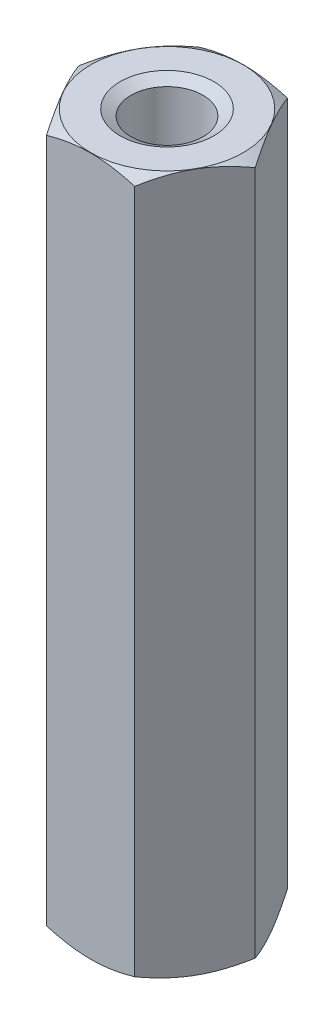
ISO-10303-21;
HEADER;
FILE_DESCRIPTION(('STEP AP214'),'2;1');
FILE_NAME('part.step','',(''),(''),'','','');
FILE_SCHEMA(('AUTOMOTIVE_DESIGN { 1 0 10303 214 1 1 1 1 }'));
ENDSEC;
DATA;
#1=APPLICATION_CONTEXT('core data for automotive mechanical design processes');
#2=APPLICATION_PROTOCOL_DEFINITION('international standard','automotive_design',2000,#1);
#3=PRODUCT_CONTEXT('',#1,'mechanical');
#4=PRODUCT('Part','Part','',(#3));
#5=PRODUCT_RELATED_PRODUCT_CATEGORY('part','',(#4));
#6=PRODUCT_DEFINITION_FORMATION('','',#4);
#7=PRODUCT_DEFINITION_CONTEXT('part definition',#1,'design');
#8=PRODUCT_DEFINITION('design','',#6,#7);
#9=PRODUCT_DEFINITION_SHAPE('','',#8);
#10=(LENGTH_UNIT() NAMED_UNIT(*) SI_UNIT(.MILLI.,.METRE.));
#11=(NAMED_UNIT(*) PLANE_ANGLE_UNIT() SI_UNIT($,.RADIAN.));
#12=(NAMED_UNIT(*) SI_UNIT($,.STERADIAN.) SOLID_ANGLE_UNIT());
#13=UNCERTAINTY_MEASURE_WITH_UNIT(LENGTH_MEASURE(1.E-05),#10,'distance_accuracy_value','');
#14=(GEOMETRIC_REPRESENTATION_CONTEXT(3) GLOBAL_UNCERTAINTY_ASSIGNED_CONTEXT((#13)) GLOBAL_UNIT_ASSIGNED_CONTEXT((#10,
#11,#12)) REPRESENTATION_CONTEXT('',''));
#15=CARTESIAN_POINT('',(0.,0.,0.));
#16=DIRECTION('',(0.,0.,1.));
#17=DIRECTION('',(1.,0.,0.));
#18=AXIS2_PLACEMENT_3D('',#15,#16,#17);
#19=CARTESIAN_POINT('',(0.,32.,0.));
#20=DIRECTION('',(0.,-1.,0.));
#21=DIRECTION('',(0.,0.,-1.));
#22=AXIS2_PLACEMENT_3D('',#19,#20,#21);
#23=CYLINDRICAL_SURFACE('',#22,1.65);
#24=CARTESIAN_POINT('',(0.,22.,0.));
#25=DIRECTION('',(0.,1.,0.));
#26=DIRECTION('',(0.,0.,1.));
#27=AXIS2_PLACEMENT_3D('',#24,#25,#26);
#28=CIRCLE('',#27,1.65);
#29=CARTESIAN_POINT('',(0.,22.,1.65));
#30=VERTEX_POINT('',#29);
#31=EDGE_CURVE('E12',#30,#30,#28,.T.);
#32=ORIENTED_EDGE('',*,*,#31,.F.);
#33=EDGE_LOOP('',(#32));
#34=FACE_BOUND('',#33,.T.);
#35=CARTESIAN_POINT('',(0.,31.7113248654052,0.));
#36=DIRECTION('',(0.,1.,0.));
#37=DIRECTION('',(0.,0.,1.));
#38=AXIS2_PLACEMENT_3D('',#35,#36,#37);
#39=CIRCLE('',#38,1.65);
#40=CARTESIAN_POINT('',(0.,31.7113248654052,1.65));
#41=VERTEX_POINT('',#40);
#42=EDGE_CURVE('E237',#41,#41,#39,.T.);
#43=ORIENTED_EDGE('',*,*,#42,.T.);
#44=EDGE_LOOP('',(#43));
#45=FACE_BOUND('',#44,.T.);
#46=ADVANCED_FACE('F37',(#34,#45),#23,.F.);
#47=CARTESIAN_POINT('',(0.,32.,0.));
#48=DIRECTION('',(0.,-1.,0.));
#49=DIRECTION('',(0.,0.,-1.));
#50=AXIS2_PLACEMENT_3D('',#47,#48,#49);
#51=CONICAL_SURFACE('',#50,3.4914518843274,1.0471975511966);
#52=CARTESIAN_POINT('',(0.,32.,0.));
#53=DIRECTION('',(0.,1.,0.));
#54=DIRECTION('',(0.,0.,1.));
#55=AXIS2_PLACEMENT_3D('',#52,#53,#54);
#56=CIRCLE('',#55,3.4914518843274);
#57=CARTESIAN_POINT('',(0.,32.,3.4914518843274));
#58=VERTEX_POINT('',#57);
#59=EDGE_CURVE('E208',#58,#58,#56,.T.);
#60=ORIENTED_EDGE('',*,*,#59,.F.);
#61=EDGE_LOOP('',(#60));
#62=FACE_BOUND('',#61,.T.);
#63=CARTESIAN_POINT('',(-5.35857849374374,30.3205521510924,3.5));
#64=CARTESIAN_POINT('',(-5.20491403045751,30.3948084648271,3.5));
#65=CARTESIAN_POINT('',(-5.05088617612491,30.4683263995164,3.5));
#66=CARTESIAN_POINT('',(-4.74190719649084,30.6134635596016,3.5));
#67=CARTESIAN_POINT('',(-4.58695591687624,30.6850824560959,3.5));
#68=CARTESIAN_POINT('',(-4.27509622552099,30.8263770302396,3.5));
#69=CARTESIAN_POINT('',(-4.11818168783656,30.8960392357974,3.5));
#70=CARTESIAN_POINT('',(-3.80306265969026,31.0323704999176,3.5));
#71=CARTESIAN_POINT('',(-3.64485823700231,31.0990397145571,3.5));
#72=CARTESIAN_POINT('',(-3.32494702244886,31.229379278542,3.5));
#73=CARTESIAN_POINT('',(-3.16322106960971,31.293002856358,3.5));
#74=CARTESIAN_POINT('',(-2.83786134873818,31.4152653168863,3.5));
#75=CARTESIAN_POINT('',(-2.674227370713,31.4739036449315,3.5));
#76=CARTESIAN_POINT('',(-2.34512758170167,31.5846195099209,3.5));
#77=CARTESIAN_POINT('',(-2.17966651365921,31.6367110010357,3.5));
#78=CARTESIAN_POINT('',(-1.84639216513062,31.7326409859786,3.5));
#79=CARTESIAN_POINT('',(-1.67857964681101,31.776482090398,3.5));
#80=CARTESIAN_POINT('',(-1.3404875008226,31.8537825659073,3.5));
#81=CARTESIAN_POINT('',(-1.17020722053807,31.8872391362949,3.5));
#82=CARTESIAN_POINT('',(-0.827594432363124,31.9415173336985,3.5));
#83=CARTESIAN_POINT('',(-0.655261922535621,31.9623389487876,3.5));
#84=CARTESIAN_POINT('',(-0.310537346323199,31.989505232516,3.5));
#85=CARTESIAN_POINT('',(-0.138152684693768,31.9959414800299,3.5));
#86=CARTESIAN_POINT('',(0.206494795849504,31.9939953970411,3.5));
#87=CARTESIAN_POINT('',(0.378757634768917,31.9856169096113,3.5));
#88=CARTESIAN_POINT('',(0.672942945410755,31.9592467693394,3.5));
#89=CARTESIAN_POINT('',(0.795190021295254,31.9446845209183,3.5));
#90=CARTESIAN_POINT('',(1.03873939048154,31.9090466412884,3.5));
#91=CARTESIAN_POINT('',(1.16004153159819,31.8879699822705,3.5));
#92=CARTESIAN_POINT('',(1.52243191697649,31.8160745949982,3.5));
#93=CARTESIAN_POINT('',(1.76182098336089,31.7566089830673,3.5));
#94=CARTESIAN_POINT('',(2.12002898254784,31.6540526908981,3.5));
#95=CARTESIAN_POINT('',(2.24071521648908,31.6171183640755,3.5));
#96=CARTESIAN_POINT('',(2.48082802657995,31.5395964927002,3.5));
#97=CARTESIAN_POINT('',(2.60025540911664,31.4990114684414,3.5));
#98=CARTESIAN_POINT('',(2.83735110002755,31.4150325899067,3.5));
#99=CARTESIAN_POINT('',(2.95502552628629,31.3716558339884,3.5));
#100=CARTESIAN_POINT('',(3.1894615067228,31.2823572835833,3.5));
#101=CARTESIAN_POINT('',(3.30622266964797,31.2364344599011,3.49999999999999));
#102=CARTESIAN_POINT('',(3.42256171440306,31.189489882174,3.49999999999999));
#103=B_SPLINE_CURVE_WITH_KNOTS('',3,(#63,#64,#65,#66,#67,#68,#69,#70,#71,#72,#73,#74,#75,#76,
#77,#78,#79,#80,#81,#82,#83,#84,#85,#86,#87,#88,#89,#90,#91,#92,#93,#94,#95,#96,#97,#98,#99,
#100,#101,#102),.UNSPECIFIED.,.F.,.F.,(4,2,2,2,2,2,2,2,2,2,2,2,2,2,2,2,2,2,2,4),(0.,
0.512003855918903,1.02409581608737,1.539119467441,2.05411623028969,2.57542513631852,
3.09679196832838,3.6170279819411,4.13709910441739,4.65731036812197,5.17752212288784,
5.69441260264372,6.2111690161251,6.58032281298954,6.94953488274053,7.68850876311462,
8.06711286361377,8.44545756824512,8.82167239780528,9.19804042922897),.UNSPECIFIED.);
#104=CARTESIAN_POINT('',(-2.0207259421637,31.6824573519457,3.5));
#105=VERTEX_POINT('',#104);
#106=CARTESIAN_POINT('',(2.02072594216372,31.6824573519457,3.5));
#107=VERTEX_POINT('',#106);
#108=EDGE_CURVE('E89',#105,#107,#103,.T.);
#109=ORIENTED_EDGE('',*,*,#108,.T.);
#110=CARTESIAN_POINT('',(2.02061047210985,31.682390682422,3.5002));
#111=CARTESIAN_POINT('',(2.10941108799267,31.7336789541254,3.34639282154755));
#112=CARTESIAN_POINT('',(2.19897822522909,31.7803237892992,3.19125798916557));
#113=CARTESIAN_POINT('',(2.37966345361545,31.861742867582,2.87830199342322));
#114=CARTESIAN_POINT('',(2.47078475532382,31.8964883075308,2.7204752692125));
#115=CARTESIAN_POINT('',(2.65189807961074,31.9505747159325,2.40677778961987));
#116=CARTESIAN_POINT('',(2.74186223545399,31.970275656855,2.2509553008393));
#117=CARTESIAN_POINT('',(2.92221386641056,31.9937946103781,1.93857711279462));
#118=CARTESIAN_POINT('',(3.01260068598001,31.9976320985698,1.78202254896577));
#119=CARTESIAN_POINT('',(3.1814939814933,31.9896494412384,1.48949078007901));
#120=CARTESIAN_POINT('',(3.26002573814993,31.9797893090458,1.35346978754209));
#121=CARTESIAN_POINT('',(3.41657761679353,31.948538276216,1.08231397971101));
#122=CARTESIAN_POINT('',(3.49459719728457,31.9271366998296,0.947180102315321));
#123=CARTESIAN_POINT('',(3.65147186489428,31.8736343352348,0.675465207594823));
#124=CARTESIAN_POINT('',(3.73030709667643,31.8413067486703,0.538918580721672));
#125=CARTESIAN_POINT('',(3.88680174018324,31.7679358093074,0.26786190705551));
#126=CARTESIAN_POINT('',(3.96446315689008,31.7269096965455,0.133348387531477));
#127=CARTESIAN_POINT('',(4.04156735438121,31.682390682422,-0.000199999999985557));
#128=B_SPLINE_CURVE_WITH_KNOTS('',3,(#110,#111,#112,#113,#114,#115,#116,#117,#118,#119,#120,
#121,#122,#123,#124,#125,#126,#127),.UNSPECIFIED.,.F.,.F.,(4,2,2,2,2,2,2,2,4),(0.,
0.554793832886253,1.11092123814984,1.65328467083219,2.19498204478403,2.66665130850859,
3.13875761298266,3.62133612600508,4.10296698719185),.UNSPECIFIED.);
#129=CARTESIAN_POINT('',(4.04145188432737,31.6824573519457,0.));
#130=VERTEX_POINT('',#129);
#131=EDGE_CURVE('E200',#107,#130,#128,.T.);
#132=ORIENTED_EDGE('',*,*,#131,.T.);
#133=CARTESIAN_POINT('',(4.04156735438121,31.682390682422,0.000200000000013609));
#134=CARTESIAN_POINT('',(3.95276673849839,31.7336789541254,-0.153607178452436));
#135=CARTESIAN_POINT('',(3.86319960126197,31.7803237892992,-0.30874201083441));
#136=CARTESIAN_POINT('',(3.68251437287562,31.861742867582,-0.621698006576767));
#137=CARTESIAN_POINT('',(3.59139307116724,31.8964883075308,-0.779524730787481));
#138=CARTESIAN_POINT('',(3.41027974688033,31.9505747159325,-1.09322221038011));
#139=CARTESIAN_POINT('',(3.32031559103707,31.970275656855,-1.24904469916068));
#140=CARTESIAN_POINT('',(3.13996396008051,31.9937946103781,-1.56142288720536));
#141=CARTESIAN_POINT('',(3.04957714051106,31.9976320985698,-1.71797745103421));
#142=CARTESIAN_POINT('',(2.88068384499777,31.9896494412384,-2.01050921992097));
#143=CARTESIAN_POINT('',(2.80215208834114,31.9797893090458,-2.14653021245789));
#144=CARTESIAN_POINT('',(2.64560020969753,31.948538276216,-2.41768602028898));
#145=CARTESIAN_POINT('',(2.56758062920649,31.9271366998296,-2.55281989768467));
#146=CARTESIAN_POINT('',(2.41070596159677,31.8736343352348,-2.82453479240518));
#147=CARTESIAN_POINT('',(2.33187072981462,31.8413067486703,-2.96108141927833));
#148=CARTESIAN_POINT('',(2.17537608630781,31.7679358093074,-3.2321380929445));
#149=CARTESIAN_POINT('',(2.09771466960097,31.7269096965455,-3.36665161246854));
#150=CARTESIAN_POINT('',(2.02061047210984,31.682390682422,-3.5002));
#151=B_SPLINE_CURVE_WITH_KNOTS('',3,(#133,#134,#135,#136,#137,#138,#139,#140,#141,#142,#143,
#144,#145,#146,#147,#148,#149,#150),.UNSPECIFIED.,.F.,.F.,(4,2,2,2,2,2,2,2,4),(0.,
0.554793832886252,1.11092123814983,1.65328467083218,2.19498204478402,2.6666513085086,
3.13875761298268,3.62133612600511,4.10296698719189),.UNSPECIFIED.);
#152=CARTESIAN_POINT('',(2.02072594216367,31.6824573519457,-3.5));
#153=VERTEX_POINT('',#152);
#154=EDGE_CURVE('E194',#130,#153,#151,.T.);
#155=ORIENTED_EDGE('',*,*,#154,.T.);
#156=CARTESIAN_POINT('',(-5.35857849374374,30.3205521510924,-3.5));
#157=CARTESIAN_POINT('',(-5.20491403045751,30.3948084648271,-3.5));
#158=CARTESIAN_POINT('',(-5.05088617612491,30.4683263995164,-3.5));
#159=CARTESIAN_POINT('',(-4.74190719649084,30.6134635596016,-3.5));
#160=CARTESIAN_POINT('',(-4.58695591687624,30.6850824560959,-3.5));
#161=CARTESIAN_POINT('',(-4.27509622552099,30.8263770302396,-3.5));
#162=CARTESIAN_POINT('',(-4.11818168783656,30.8960392357974,-3.5));
#163=CARTESIAN_POINT('',(-3.80306265969026,31.0323704999176,-3.5));
#164=CARTESIAN_POINT('',(-3.64485823700231,31.0990397145571,-3.5));
#165=CARTESIAN_POINT('',(-3.32494702244886,31.229379278542,-3.5));
#166=CARTESIAN_POINT('',(-3.16322106960971,31.293002856358,-3.5));
#167=CARTESIAN_POINT('',(-2.83786134873817,31.4152653168863,-3.5));
#168=CARTESIAN_POINT('',(-2.674227370713,31.4739036449315,-3.5));
#169=CARTESIAN_POINT('',(-2.34512758170167,31.5846195099209,-3.5));
#170=CARTESIAN_POINT('',(-2.17966651365921,31.6367110010357,-3.5));
#171=CARTESIAN_POINT('',(-1.84639216513062,31.7326409859786,-3.5));
#172=CARTESIAN_POINT('',(-1.67857964681101,31.776482090398,-3.5));
#173=CARTESIAN_POINT('',(-1.34048750082259,31.8537825659073,-3.5));
#174=CARTESIAN_POINT('',(-1.17020722053807,31.8872391362949,-3.5));
#175=CARTESIAN_POINT('',(-0.827594432363122,31.9415173336985,-3.5));
#176=CARTESIAN_POINT('',(-0.655261922535619,31.9623389487876,-3.5));
#177=CARTESIAN_POINT('',(-0.310537346323198,31.989505232516,-3.5));
#178=CARTESIAN_POINT('',(-0.138152684693768,31.9959414800299,-3.5));
#179=CARTESIAN_POINT('',(0.206494795849504,31.9939953970411,-3.5));
#180=CARTESIAN_POINT('',(0.378757634768916,31.9856169096113,-3.5));
#181=CARTESIAN_POINT('',(0.672942945410755,31.9592467693394,-3.5));
#182=CARTESIAN_POINT('',(0.795190021295254,31.9446845209183,-3.5));
#183=CARTESIAN_POINT('',(1.03873939048154,31.9090466412884,-3.5));
#184=CARTESIAN_POINT('',(1.16004153159819,31.8879699822705,-3.5));
#185=CARTESIAN_POINT('',(1.52243191697649,31.8160745949981,-3.5));
#186=CARTESIAN_POINT('',(1.7618209833609,31.7566089830673,-3.5));
#187=CARTESIAN_POINT('',(2.12002898254784,31.6540526908981,-3.5));
#188=CARTESIAN_POINT('',(2.24071521648908,31.6171183640755,-3.5));
#189=CARTESIAN_POINT('',(2.48082802657995,31.5395964927002,-3.5));
#190=CARTESIAN_POINT('',(2.60025540911664,31.4990114684414,-3.5));
#191=CARTESIAN_POINT('',(2.83735110002756,31.4150325899067,-3.5));
#192=CARTESIAN_POINT('',(2.9550255262863,31.3716558339884,-3.5));
#193=CARTESIAN_POINT('',(3.1894615067228,31.2823572835832,-3.5));
#194=CARTESIAN_POINT('',(3.30622266964798,31.2364344599011,-3.5));
#195=CARTESIAN_POINT('',(3.42256171440306,31.189489882174,-3.5));
#196=B_SPLINE_CURVE_WITH_KNOTS('',3,(#156,#157,#158,#159,#160,#161,#162,#163,#164,#165,#166,
#167,#168,#169,#170,#171,#172,#173,#174,#175,#176,#177,#178,#179,#180,#181,#182,#183,#184,#185,
#186,#187,#188,#189,#190,#191,#192,#193,#194,#195),.UNSPECIFIED.,.F.,.F.,(4,2,2,2,2,2,2,2,2,2,2,
2,2,2,2,2,2,2,2,4),(0.,0.5120038559189,1.02409581608737,1.539119467441,2.05411623028969,
2.57542513631852,3.09679196832839,3.6170279819411,4.13709910441739,4.65731036812197,
5.17752212288784,5.69441260264372,6.2111690161251,6.58032281298954,6.94953488274053,
7.68850876311462,8.06711286361377,8.44545756824512,8.82167239780529,9.19804042922898),.UNSPECIFIED.);
#197=CARTESIAN_POINT('',(-2.0207259421637,31.6824573519457,-3.5));
#198=VERTEX_POINT('',#197);
#199=EDGE_CURVE('E110',#153,#198,#196,.F.);
#200=ORIENTED_EDGE('',*,*,#199,.T.);
#201=CARTESIAN_POINT('',(-2.02061047210986,31.682390682422,-3.5002));
#202=CARTESIAN_POINT('',(-2.10941108799268,31.7336789541254,-3.34639282154755));
#203=CARTESIAN_POINT('',(-2.1989782252291,31.7803237892992,-3.19125798916558));
#204=CARTESIAN_POINT('',(-2.37966345361546,31.861742867582,-2.87830199342322));
#205=CARTESIAN_POINT('',(-2.47078475532383,31.8964883075308,-2.7204752692125));
#206=CARTESIAN_POINT('',(-2.65189807961075,31.9505747159325,-2.40677778961987));
#207=CARTESIAN_POINT('',(-2.74186223545401,31.970275656855,-2.25095530083931));
#208=CARTESIAN_POINT('',(-2.92221386641057,31.9937946103781,-1.93857711279462));
#209=CARTESIAN_POINT('',(-3.01260068598003,31.9976320985698,-1.78202254896577));
#210=CARTESIAN_POINT('',(-3.18149398149331,31.9896494412384,-1.48949078007901));
#211=CARTESIAN_POINT('',(-3.26002573814994,31.9797893090457,-1.35346978754209));
#212=CARTESIAN_POINT('',(-3.41657761679355,31.948538276216,-1.082313979711));
#213=CARTESIAN_POINT('',(-3.49459719728459,31.9271366998296,-0.947180102315316));
#214=CARTESIAN_POINT('',(-3.6514718648943,31.8736343352348,-0.675465207594816));
#215=CARTESIAN_POINT('',(-3.73030709667645,31.8413067486703,-0.538918580721664));
#216=CARTESIAN_POINT('',(-3.88680174018326,31.7679358093074,-0.2678619070555));
#217=CARTESIAN_POINT('',(-3.9644631568901,31.7269096965455,-0.133348387531465));
#218=CARTESIAN_POINT('',(-4.04156735438123,31.682390682422,0.000199999999998123));
#219=B_SPLINE_CURVE_WITH_KNOTS('',3,(#201,#202,#203,#204,#205,#206,#207,#208,#209,#210,#211,
#212,#213,#214,#215,#216,#217,#218),.UNSPECIFIED.,.F.,.F.,(4,2,2,2,2,2,2,2,4),(0.,
0.554793832886257,1.11092123814984,1.65328467083219,2.19498204478404,2.66665130850861,
3.13875761298268,3.6213361260051,4.10296698719187),.UNSPECIFIED.);
#220=CARTESIAN_POINT('',(-4.04145188432739,31.6824573519457,0.));
#221=VERTEX_POINT('',#220);
#222=EDGE_CURVE('E108',#198,#221,#219,.T.);
#223=ORIENTED_EDGE('',*,*,#222,.T.);
#224=CARTESIAN_POINT('',(-4.04156735438123,31.682390682422,-0.000200000000001815));
#225=CARTESIAN_POINT('',(-3.95276673849841,31.7336789541254,0.153607178452448));
#226=CARTESIAN_POINT('',(-3.86319960126199,31.7803237892992,0.308742010834423));
#227=CARTESIAN_POINT('',(-3.68251437287563,31.861742867582,0.621698006576782));
#228=CARTESIAN_POINT('',(-3.59139307116726,31.8964883075308,0.779524730787497));
#229=CARTESIAN_POINT('',(-3.41027974688035,31.9505747159325,1.09322221038013));
#230=CARTESIAN_POINT('',(-3.32031559103709,31.970275656855,1.2490446991607));
#231=CARTESIAN_POINT('',(-3.13996396008053,31.9937946103781,1.56142288720538));
#232=CARTESIAN_POINT('',(-3.04957714051107,31.9976320985698,1.71797745103424));
#233=CARTESIAN_POINT('',(-2.88068384499778,31.9896494412384,2.01050921992099));
#234=CARTESIAN_POINT('',(-2.80215208834115,31.9797893090458,2.14653021245791));
#235=CARTESIAN_POINT('',(-2.64560020969755,31.948538276216,2.417686020289));
#236=CARTESIAN_POINT('',(-2.56758062920651,31.9271366998296,2.55281989768469));
#237=CARTESIAN_POINT('',(-2.4107059615968,31.8736343352348,2.82453479240519));
#238=CARTESIAN_POINT('',(-2.33187072981465,31.8413067486703,2.96108141927834));
#239=CARTESIAN_POINT('',(-2.17537608630784,31.7679358093074,3.2321380929445));
#240=CARTESIAN_POINT('',(-2.097714669601,31.7269096965455,3.36665161246854));
#241=CARTESIAN_POINT('',(-2.02061047210987,31.682390682422,3.5002));
#242=B_SPLINE_CURVE_WITH_KNOTS('',3,(#224,#225,#226,#227,#228,#229,#230,#231,#232,#233,#234,
#235,#236,#237,#238,#239,#240,#241),.UNSPECIFIED.,.F.,.F.,(4,2,2,2,2,2,2,2,4),(0.,
0.554793832886256,1.11092123814984,1.65328467083219,2.19498204478404,2.66665130850861,
3.13875761298268,3.6213361260051,4.10296698719187),.UNSPECIFIED.);
#243=EDGE_CURVE('E94',#221,#105,#242,.T.);
#244=ORIENTED_EDGE('',*,*,#243,.T.);
#245=EDGE_LOOP('',(#109,#132,#155,#200,#223,#244));
#246=FACE_BOUND('',#245,.T.);
#247=ADVANCED_FACE('F106',(#62,#246),#51,.T.);
#248=CARTESIAN_POINT('',(0.,0.317542648054302,0.));
#249=DIRECTION('',(0.,1.,0.));
#250=DIRECTION('',(0.,0.,1.));
#251=AXIS2_PLACEMENT_3D('',#248,#249,#250);
#252=CONICAL_SURFACE('',#251,4.04145188432739,1.04719755119659);
#253=CARTESIAN_POINT('',(0.,0.,0.));
#254=DIRECTION('',(0.,1.,0.));
#255=DIRECTION('',(0.,0.,1.));
#256=AXIS2_PLACEMENT_3D('',#253,#254,#255);
#257=CIRCLE('',#256,3.49145188432739);
#258=CARTESIAN_POINT('',(0.,0.,3.49145188432739));
#259=VERTEX_POINT('',#258);
#260=EDGE_CURVE('E249',#259,#259,#257,.F.);
#261=ORIENTED_EDGE('',*,*,#260,.F.);
#262=EDGE_LOOP('',(#261));
#263=FACE_BOUND('',#262,.T.);
#264=CARTESIAN_POINT('',(2.02061047210984,0.317609317578018,-3.5002));
#265=CARTESIAN_POINT('',(2.10941108799265,0.26632104587463,-3.34639282154755));
#266=CARTESIAN_POINT('',(2.19897822522907,0.219676210700843,-3.19125798916558));
#267=CARTESIAN_POINT('',(2.37966345361543,0.138257132417993,-2.87830199342322));
#268=CARTESIAN_POINT('',(2.4707847553238,0.103511692469205,-2.72047526921251));
#269=CARTESIAN_POINT('',(2.65189807961072,0.0494252840674783,-2.40677778961988));
#270=CARTESIAN_POINT('',(2.74186223545397,0.0297243431450233,-2.25095530083931));
#271=CARTESIAN_POINT('',(2.92221386641054,0.00620538962189522,-1.93857711279463));
#272=CARTESIAN_POINT('',(3.01260068597999,0.0023679014302057,-1.78202254896577));
#273=CARTESIAN_POINT('',(3.18149398149328,0.0103505587616175,-1.48949078007901));
#274=CARTESIAN_POINT('',(3.26002573814991,0.0202106909542469,-1.35346978754209));
#275=CARTESIAN_POINT('',(3.41657761679352,0.0514617237840437,-1.082313979711));
#276=CARTESIAN_POINT('',(3.49459719728456,0.0728633001704388,-0.947180102315314));
#277=CARTESIAN_POINT('',(3.65147186489428,0.126365664765219,-0.67546520759481));
#278=CARTESIAN_POINT('',(3.73030709667643,0.158693251329729,-0.538918580721657));
#279=CARTESIAN_POINT('',(3.88680174018323,0.232064190692638,-0.267861907055488));
#280=CARTESIAN_POINT('',(3.96446315689008,0.273090303454512,-0.133348387531451));
#281=CARTESIAN_POINT('',(4.04156735438121,0.317609317578017,0.000200000000013655));
#282=B_SPLINE_CURVE_WITH_KNOTS('',3,(#264,#265,#266,#267,#268,#269,#270,#271,#272,#273,#274,
#275,#276,#277,#278,#279,#280,#281),.UNSPECIFIED.,.F.,.F.,(4,2,2,2,2,2,2,2,4),(0.,
0.554793832886254,1.11092123814984,1.65328467083219,2.19498204478403,2.6666513085086,
3.13875761298268,3.62133612600511,4.10296698719189),.UNSPECIFIED.);
#283=CARTESIAN_POINT('',(2.02072594216367,0.31754264805429,-3.5));
#284=VERTEX_POINT('',#283);
#285=CARTESIAN_POINT('',(4.04145188432737,0.31754264805429,0.));
#286=VERTEX_POINT('',#285);
#287=EDGE_CURVE('E171',#284,#286,#282,.T.);
#288=ORIENTED_EDGE('',*,*,#287,.T.);
#289=CARTESIAN_POINT('',(4.04156735438121,0.317609317578017,-0.000199999999986391));
#290=CARTESIAN_POINT('',(3.95276673849839,0.266321045874629,0.153607178452463));
#291=CARTESIAN_POINT('',(3.86319960126197,0.219676210700843,0.308742010834437));
#292=CARTESIAN_POINT('',(3.68251437287561,0.138257132417995,0.621698006576795));
#293=CARTESIAN_POINT('',(3.59139307116724,0.103511692469208,0.77952473078751));
#294=CARTESIAN_POINT('',(3.41027974688033,0.0494252840674827,1.09322221038014));
#295=CARTESIAN_POINT('',(3.32031559103707,0.0297243431450283,1.24904469916071));
#296=CARTESIAN_POINT('',(3.13996396008051,0.00620538962190164,1.56142288720539));
#297=CARTESIAN_POINT('',(3.04957714051105,0.00236790143021296,1.71797745103424));
#298=CARTESIAN_POINT('',(2.88068384499777,0.0103505587616263,2.010509219921));
#299=CARTESIAN_POINT('',(2.80215208834114,0.020210690954256,2.14653021245792));
#300=CARTESIAN_POINT('',(2.64560020969753,0.0514617237840529,2.417686020289));
#301=CARTESIAN_POINT('',(2.56758062920649,0.0728633001704476,2.55281989768469));
#302=CARTESIAN_POINT('',(2.41070596159678,0.126365664765227,2.82453479240519));
#303=CARTESIAN_POINT('',(2.33187072981463,0.158693251329736,2.96108141927834));
#304=CARTESIAN_POINT('',(2.17537608630783,0.232064190692644,3.2321380929445));
#305=CARTESIAN_POINT('',(2.09771466960098,0.273090303454516,3.36665161246853));
#306=CARTESIAN_POINT('',(2.02061047210985,0.31760931757802,3.5002));
#307=B_SPLINE_CURVE_WITH_KNOTS('',3,(#289,#290,#291,#292,#293,#294,#295,#296,#297,#298,#299,
#300,#301,#302,#303,#304,#305,#306),.UNSPECIFIED.,.F.,.F.,(4,2,2,2,2,2,2,2,4),(0.,
0.554793832886253,1.11092123814984,1.65328467083219,2.19498204478403,2.66665130850859,
3.13875761298266,3.62133612600508,4.10296698719185),.UNSPECIFIED.);
#308=CARTESIAN_POINT('',(2.02072594216369,0.317542648054292,3.5));
#309=VERTEX_POINT('',#308);
#310=EDGE_CURVE('E177',#286,#309,#307,.T.);
#311=ORIENTED_EDGE('',*,*,#310,.T.);
#312=CARTESIAN_POINT('',(-5.35857849374374,1.67944784890759,3.5));
#313=CARTESIAN_POINT('',(-5.20491403045751,1.60519153517297,3.5));
#314=CARTESIAN_POINT('',(-5.05088617612491,1.53167360048366,3.5));
#315=CARTESIAN_POINT('',(-4.74190719649084,1.38653644039839,3.5));
#316=CARTESIAN_POINT('',(-4.58695591687624,1.31491754390414,3.5));
#317=CARTESIAN_POINT('',(-4.27509622552099,1.17362296976044,3.5));
#318=CARTESIAN_POINT('',(-4.11818168783656,1.10396076420258,3.5));
#319=CARTESIAN_POINT('',(-3.80306265969026,0.967629500082396,3.5));
#320=CARTESIAN_POINT('',(-3.64485823700231,0.900960285442872,3.5));
#321=CARTESIAN_POINT('',(-3.32494702244885,0.770620721458049,3.5));
#322=CARTESIAN_POINT('',(-3.16322106960971,0.706997143642042,3.5));
#323=CARTESIAN_POINT('',(-2.83786134873817,0.584734683113735,3.5));
#324=CARTESIAN_POINT('',(-2.674227370713,0.526096355068478,3.5));
#325=CARTESIAN_POINT('',(-2.34512758170167,0.415380490079074,3.5));
#326=CARTESIAN_POINT('',(-2.17966651365921,0.363288998964278,3.5));
#327=CARTESIAN_POINT('',(-1.84639216513062,0.267359014021433,3.5));
#328=CARTESIAN_POINT('',(-1.67857964681101,0.223517909602018,3.5));
#329=CARTESIAN_POINT('',(-1.3404875008226,0.146217434092664,3.5));
#330=CARTESIAN_POINT('',(-1.17020722053807,0.112760863705128,3.5));
#331=CARTESIAN_POINT('',(-0.827594432363125,0.0584826663015096,3.5));
#332=CARTESIAN_POINT('',(-0.655261922535621,0.0376610512124039,3.5));
#333=CARTESIAN_POINT('',(-0.310537346323199,0.0104947674839931,3.5));
#334=CARTESIAN_POINT('',(-0.138152684693767,0.00405851997014556,3.5));
#335=CARTESIAN_POINT('',(0.206494795849506,0.00600460295888131,3.5));
#336=CARTESIAN_POINT('',(0.37875763476892,0.0143830903886686,3.5));
#337=CARTESIAN_POINT('',(0.672942945410758,0.0407532306606468,3.5));
#338=CARTESIAN_POINT('',(0.795190021295255,0.0553154790817016,3.5));
#339=CARTESIAN_POINT('',(1.03873939048154,0.0909533587115625,3.5));
#340=CARTESIAN_POINT('',(1.16004153159819,0.112030017729553,3.5));
#341=CARTESIAN_POINT('',(1.52243191697648,0.18392540500186,3.5));
#342=CARTESIAN_POINT('',(1.76182098336089,0.24339101693273,3.5));
#343=CARTESIAN_POINT('',(2.12002898254783,0.345947309101914,3.5));
#344=CARTESIAN_POINT('',(2.24071521648906,0.382881635924509,3.5));
#345=CARTESIAN_POINT('',(2.48082802657993,0.460403507299816,3.5));
#346=CARTESIAN_POINT('',(2.60025540911662,0.500988531558587,3.5));
#347=CARTESIAN_POINT('',(2.83735110002753,0.584967410093273,3.5));
#348=CARTESIAN_POINT('',(2.95502552628627,0.628344166011571,3.5));
#349=CARTESIAN_POINT('',(3.18946150672277,0.717642716416755,3.5));
#350=CARTESIAN_POINT('',(3.30622266964794,0.763565540098898,3.49999999999999));
#351=CARTESIAN_POINT('',(3.42256171440302,0.810510117826047,3.49999999999999));
#352=B_SPLINE_CURVE_WITH_KNOTS('',3,(#312,#313,#314,#315,#316,#317,#318,#319,#320,#321,#322,
#323,#324,#325,#326,#327,#328,#329,#330,#331,#332,#333,#334,#335,#336,#337,#338,#339,#340,#341,
#342,#343,#344,#345,#346,#347,#348,#349,#350,#351),.UNSPECIFIED.,.F.,.F.,(4,2,2,2,2,2,2,2,2,2,2,
2,2,2,2,2,2,2,2,4),(0.,0.512003855918902,1.02409581608737,1.53911946744101,2.05411623028969,
2.57542513631853,3.09679196832839,3.61702798194111,4.1370991044174,4.65731036812197,
5.17752212288785,5.69441260264373,6.21116901612511,6.58032281298954,6.94953488274053,
7.68850876311462,8.06711286361376,8.4454575682451,8.82167239780526,9.19804042922894),.UNSPECIFIED.);
#353=CARTESIAN_POINT('',(-2.02072594216372,0.317542648054302,3.5));
#354=VERTEX_POINT('',#353);
#355=EDGE_CURVE('E145',#309,#354,#352,.F.);
#356=ORIENTED_EDGE('',*,*,#355,.T.);
#357=CARTESIAN_POINT('',(-2.02061047210987,0.317609317578025,3.5002));
#358=CARTESIAN_POINT('',(-2.10941108799268,0.266321045874638,3.34639282154755));
#359=CARTESIAN_POINT('',(-2.19897822522911,0.219676210700851,3.19125798916558));
#360=CARTESIAN_POINT('',(-2.37966345361546,0.138257132418002,2.87830199342322));
#361=CARTESIAN_POINT('',(-2.47078475532384,0.103511692469215,2.7204752692125));
#362=CARTESIAN_POINT('',(-2.65189807961075,0.0494252840674897,2.40677778961987));
#363=CARTESIAN_POINT('',(-2.74186223545401,0.029724343145035,2.2509553008393));
#364=CARTESIAN_POINT('',(-2.92221386641057,0.00620538962190816,1.93857711279462));
#365=CARTESIAN_POINT('',(-3.01260068598003,0.00236790143021945,1.78202254896576));
#366=CARTESIAN_POINT('',(-3.18149398149331,0.0103505587616328,1.489490780079));
#367=CARTESIAN_POINT('',(-3.26002573814994,0.0202106909542627,1.35346978754209));
#368=CARTESIAN_POINT('',(-3.41657761679355,0.0514617237840599,1.082313979711));
#369=CARTESIAN_POINT('',(-3.49459719728459,0.0728633001704548,0.947180102315313));
#370=CARTESIAN_POINT('',(-3.6514718648943,0.126365664765234,0.675465207594813));
#371=CARTESIAN_POINT('',(-3.73030709667645,0.158693251329744,0.538918580721661));
#372=CARTESIAN_POINT('',(-3.88680174018326,0.232064190692652,0.267861907055496));
#373=CARTESIAN_POINT('',(-3.9644631568901,0.273090303454525,0.133348387531461));
#374=CARTESIAN_POINT('',(-4.04156735438123,0.31760931757803,-0.000200000000001569));
#375=B_SPLINE_CURVE_WITH_KNOTS('',3,(#357,#358,#359,#360,#361,#362,#363,#364,#365,#366,#367,
#368,#369,#370,#371,#372,#373,#374),.UNSPECIFIED.,.F.,.F.,(4,2,2,2,2,2,2,2,4),(0.,
0.554793832886255,1.11092123814984,1.65328467083219,2.19498204478404,2.6666513085086,
3.13875761298268,3.6213361260051,4.10296698719187),.UNSPECIFIED.);
#376=CARTESIAN_POINT('',(-4.04145188432739,0.317542648054302,0.));
#377=VERTEX_POINT('',#376);
#378=EDGE_CURVE('E101',#354,#377,#375,.T.);
#379=ORIENTED_EDGE('',*,*,#378,.T.);
#380=CARTESIAN_POINT('',(-4.04156735438123,0.31760931757803,0.000199999999998252));
#381=CARTESIAN_POINT('',(-3.95276673849841,0.266321045874642,-0.153607178452452));
#382=CARTESIAN_POINT('',(-3.86319960126199,0.219676210700854,-0.308742010834427));
#383=CARTESIAN_POINT('',(-3.68251437287563,0.138257132418005,-0.621698006576786));
#384=CARTESIAN_POINT('',(-3.59139307116726,0.103511692469217,-0.779524730787501));
#385=CARTESIAN_POINT('',(-3.41027974688035,0.0494252840674913,-1.09322221038013));
#386=CARTESIAN_POINT('',(-3.32031559103709,0.0297243431450366,-1.2490446991607));
#387=CARTESIAN_POINT('',(-3.13996396008052,0.00620538962190917,-1.56142288720538));
#388=CARTESIAN_POINT('',(-3.04957714051107,0.00236790143022001,-1.71797745103424));
#389=CARTESIAN_POINT('',(-2.88068384499778,0.0103505587616328,-2.010509219921));
#390=CARTESIAN_POINT('',(-2.80215208834115,0.0202106909542625,-2.14653021245792));
#391=CARTESIAN_POINT('',(-2.64560020969754,0.0514617237840593,-2.417686020289));
#392=CARTESIAN_POINT('',(-2.56758062920651,0.072863300170454,-2.55281989768469));
#393=CARTESIAN_POINT('',(-2.41070596159679,0.126365664765233,-2.82453479240519));
#394=CARTESIAN_POINT('',(-2.33187072981464,0.158693251329743,-2.96108141927834));
#395=CARTESIAN_POINT('',(-2.17537608630784,0.23206419069265,-3.23213809294451));
#396=CARTESIAN_POINT('',(-2.09771466960099,0.273090303454523,-3.36665161246854));
#397=CARTESIAN_POINT('',(-2.02061047210986,0.317609317578027,-3.5002));
#398=B_SPLINE_CURVE_WITH_KNOTS('',3,(#380,#381,#382,#383,#384,#385,#386,#387,#388,#389,#390,
#391,#392,#393,#394,#395,#396,#397),.UNSPECIFIED.,.F.,.F.,(4,2,2,2,2,2,2,2,4),(0.,
0.554793832886256,1.11092123814984,1.6532846708322,2.19498204478404,2.66665130850861,
3.13875761298268,3.6213361260051,4.10296698719188),.UNSPECIFIED.);
#399=CARTESIAN_POINT('',(-2.0207259421637,0.317542648054299,-3.5));
#400=VERTEX_POINT('',#399);
#401=EDGE_CURVE('E144',#377,#400,#398,.T.);
#402=ORIENTED_EDGE('',*,*,#401,.T.);
#403=CARTESIAN_POINT('',(-5.35857849374374,1.67944784890759,-3.5));
#404=CARTESIAN_POINT('',(-5.20491403045751,1.60519153517298,-3.5));
#405=CARTESIAN_POINT('',(-5.05088617612491,1.53167360048366,-3.5));
#406=CARTESIAN_POINT('',(-4.74190719649084,1.38653644039839,-3.5));
#407=CARTESIAN_POINT('',(-4.58695591687624,1.31491754390414,-3.5));
#408=CARTESIAN_POINT('',(-4.275096225521,1.17362296976045,-3.5));
#409=CARTESIAN_POINT('',(-4.11818168783657,1.10396076420258,-3.5));
#410=CARTESIAN_POINT('',(-3.80306265969026,0.967629500082398,-3.5));
#411=CARTESIAN_POINT('',(-3.64485823700232,0.900960285442875,-3.5));
#412=CARTESIAN_POINT('',(-3.32494702244886,0.770620721458051,-3.5));
#413=CARTESIAN_POINT('',(-3.16322106960971,0.706997143642044,-3.5));
#414=CARTESIAN_POINT('',(-2.83786134873818,0.584734683113738,-3.5));
#415=CARTESIAN_POINT('',(-2.674227370713,0.52609635506848,-3.5));
#416=CARTESIAN_POINT('',(-2.34512758170167,0.415380490079076,-3.5));
#417=CARTESIAN_POINT('',(-2.17966651365921,0.36328899896428,-3.5));
#418=CARTESIAN_POINT('',(-1.84639216513062,0.267359014021435,-3.5));
#419=CARTESIAN_POINT('',(-1.67857964681101,0.22351790960202,-3.5));
#420=CARTESIAN_POINT('',(-1.3404875008226,0.146217434092667,-3.5));
#421=CARTESIAN_POINT('',(-1.17020722053807,0.11276086370513,-3.5));
#422=CARTESIAN_POINT('',(-0.827594432363124,0.0584826663015122,-3.5));
#423=CARTESIAN_POINT('',(-0.65526192253562,0.0376610512124064,-3.5));
#424=CARTESIAN_POINT('',(-0.310537346323197,0.0104947674839957,-3.5));
#425=CARTESIAN_POINT('',(-0.138152684693765,0.00405851997014842,-3.5));
#426=CARTESIAN_POINT('',(0.206494795849508,0.00600460295888441,-3.5));
#427=CARTESIAN_POINT('',(0.378757634768922,0.0143830903886717,-3.5));
#428=CARTESIAN_POINT('',(0.672942945410759,0.0407532306606501,-3.5));
#429=CARTESIAN_POINT('',(0.795190021295256,0.0553154790817052,-3.5));
#430=CARTESIAN_POINT('',(1.03873939048154,0.0909533587115663,-3.5));
#431=CARTESIAN_POINT('',(1.16004153159819,0.112030017729556,-3.5));
#432=CARTESIAN_POINT('',(1.52243191697648,0.183925405001864,-3.5));
#433=CARTESIAN_POINT('',(1.76182098336089,0.243391016932734,-3.5));
#434=CARTESIAN_POINT('',(2.12002898254783,0.345947309101918,-3.5));
#435=CARTESIAN_POINT('',(2.24071521648906,0.382881635924514,-3.5));
#436=CARTESIAN_POINT('',(2.48082802657993,0.46040350729982,-3.5));
#437=CARTESIAN_POINT('',(2.60025540911662,0.500988531558592,-3.5));
#438=CARTESIAN_POINT('',(2.83735110002753,0.584967410093279,-3.5));
#439=CARTESIAN_POINT('',(2.95502552628627,0.628344166011576,-3.5));
#440=CARTESIAN_POINT('',(3.18946150672277,0.717642716416761,-3.5));
#441=CARTESIAN_POINT('',(3.30622266964795,0.763565540098904,-3.5));
#442=CARTESIAN_POINT('',(3.42256171440303,0.810510117826053,-3.5));
#443=B_SPLINE_CURVE_WITH_KNOTS('',3,(#403,#404,#405,#406,#407,#408,#409,#410,#411,#412,#413,
#414,#415,#416,#417,#418,#419,#420,#421,#422,#423,#424,#425,#426,#427,#428,#429,#430,#431,#432,
#433,#434,#435,#436,#437,#438,#439,#440,#441,#442),.UNSPECIFIED.,.F.,.F.,(4,2,2,2,2,2,2,2,2,2,2,
2,2,2,2,2,2,2,2,4),(0.,0.512003855918902,1.02409581608737,1.53911946744101,2.05411623028969,
2.57542513631853,3.09679196832839,3.61702798194111,4.1370991044174,4.65731036812198,
5.17752212288786,5.69441260264373,6.21116901612511,6.58032281298955,6.94953488274054,
7.68850876311462,8.06711286361377,8.44545756824511,8.82167239780527,9.19804042922895),.UNSPECIFIED.);
#444=EDGE_CURVE('E166',#400,#284,#443,.T.);
#445=ORIENTED_EDGE('',*,*,#444,.T.);
#446=EDGE_LOOP('',(#288,#311,#356,#379,#402,#445));
#447=FACE_BOUND('',#446,.T.);
#448=ADVANCED_FACE('F154',(#263,#447),#252,.T.);
#449=CARTESIAN_POINT('',(0.,32.,0.));
#450=DIRECTION('',(0.,1.,0.));
#451=DIRECTION('',(0.,0.,1.));
#452=AXIS2_PLACEMENT_3D('',#449,#450,#451);
#453=PLANE('',#452);
#454=CARTESIAN_POINT('',(0.,32.,0.));
#455=DIRECTION('',(0.,1.,0.));
#456=DIRECTION('',(0.,0.,1.));
#457=AXIS2_PLACEMENT_3D('',#454,#455,#456);
#458=CIRCLE('',#457,2.15);
#459=CARTESIAN_POINT('',(0.,32.,2.15));
#460=VERTEX_POINT('',#459);
#461=EDGE_CURVE('E41',#460,#460,#458,.F.);
#462=ORIENTED_EDGE('',*,*,#461,.T.);
#463=EDGE_LOOP('',(#462));
#464=FACE_BOUND('',#463,.T.);
#465=ORIENTED_EDGE('',*,*,#59,.T.);
#466=EDGE_LOOP('',(#465));
#467=FACE_BOUND('',#466,.T.);
#468=ADVANCED_FACE('F157',(#464,#467),#453,.T.);
#469=CARTESIAN_POINT('',(0.,0.,0.));
#470=DIRECTION('',(0.,1.,0.));
#471=DIRECTION('',(0.,0.,1.));
#472=AXIS2_PLACEMENT_3D('',#469,#470,#471);
#473=PLANE('',#472);
#474=CARTESIAN_POINT('',(0.,0.,0.));
#475=DIRECTION('',(0.,1.,0.));
#476=DIRECTION('',(0.,0.,1.));
#477=AXIS2_PLACEMENT_3D('',#474,#475,#476);
#478=CIRCLE('',#477,1.93867513459481);
#479=CARTESIAN_POINT('',(0.,0.,1.93867513459481));
#480=VERTEX_POINT('',#479);
#481=EDGE_CURVE('E240',#480,#480,#478,.T.);
#482=ORIENTED_EDGE('',*,*,#481,.T.);
#483=EDGE_LOOP('',(#482));
#484=FACE_BOUND('',#483,.T.);
#485=ORIENTED_EDGE('',*,*,#260,.T.);
#486=EDGE_LOOP('',(#485));
#487=FACE_BOUND('',#486,.T.);
#488=ADVANCED_FACE('F217',(#484,#487),#473,.F.);
#489=CARTESIAN_POINT('',(0.,10.,0.));
#490=DIRECTION('',(0.,-1.,0.));
#491=DIRECTION('',(0.,0.,-1.));
#492=AXIS2_PLACEMENT_3D('',#489,#490,#491);
#493=CIRCLE('',#492,1.65);
#494=CARTESIAN_POINT('',(0.,10.,-1.65));
#495=VERTEX_POINT('',#494);
#496=EDGE_CURVE('E46',#495,#495,#493,.T.);
#497=ORIENTED_EDGE('',*,*,#496,.F.);
#498=EDGE_LOOP('',(#497));
#499=FACE_BOUND('',#498,.T.);
#500=CARTESIAN_POINT('',(0.,0.5,0.));
#501=DIRECTION('',(0.,1.,0.));
#502=DIRECTION('',(0.,0.,1.));
#503=AXIS2_PLACEMENT_3D('',#500,#501,#502);
#504=CIRCLE('',#503,1.65);
#505=CARTESIAN_POINT('',(0.,0.5,1.65));
#506=VERTEX_POINT('',#505);
#507=EDGE_CURVE('E239',#506,#506,#504,.F.);
#508=ORIENTED_EDGE('',*,*,#507,.T.);
#509=EDGE_LOOP('',(#508));
#510=FACE_BOUND('',#509,.T.);
#511=ADVANCED_FACE('F212',(#499,#510),#23,.F.);
#512=CARTESIAN_POINT('',(2.02072594216369,32.,3.5));
#513=DIRECTION('',(0.866025403784439,0.,0.5));
#514=DIRECTION('',(0.5,0.,-0.866025403784439));
#515=AXIS2_PLACEMENT_3D('',#512,#513,#514);
#516=PLANE('',#515);
#517=ORIENTED_EDGE('',*,*,#310,.F.);
#518=DIRECTION('',(0.,-1.,0.));
#519=VECTOR('',#518,1.);
#520=CARTESIAN_POINT('',(4.04145188432737,32.,0.));
#521=LINE('',#520,#519);
#522=EDGE_CURVE('E95',#130,#286,#521,.T.);
#523=ORIENTED_EDGE('',*,*,#522,.F.);
#524=ORIENTED_EDGE('',*,*,#131,.F.);
#525=DIRECTION('',(0.,-1.,0.));
#526=VECTOR('',#525,1.);
#527=CARTESIAN_POINT('',(2.02072594216369,32.,3.5));
#528=LINE('',#527,#526);
#529=EDGE_CURVE('E54',#107,#309,#528,.T.);
#530=ORIENTED_EDGE('',*,*,#529,.T.);
#531=EDGE_LOOP('',(#517,#523,#524,#530));
#532=FACE_BOUND('',#531,.T.);
#533=ADVANCED_FACE('F187',(#532),#516,.T.);
#534=CARTESIAN_POINT('',(4.04145188432737,32.,0.));
#535=DIRECTION('',(0.866025403784439,0.,-0.5));
#536=DIRECTION('',(-0.5,0.,-0.866025403784439));
#537=AXIS2_PLACEMENT_3D('',#534,#535,#536);
#538=PLANE('',#537);
#539=ORIENTED_EDGE('',*,*,#522,.T.);
#540=ORIENTED_EDGE('',*,*,#287,.F.);
#541=DIRECTION('',(0.,-1.,0.));
#542=VECTOR('',#541,1.);
#543=CARTESIAN_POINT('',(2.02072594216367,32.,-3.5));
#544=LINE('',#543,#542);
#545=EDGE_CURVE('E259',#153,#284,#544,.T.);
#546=ORIENTED_EDGE('',*,*,#545,.F.);
#547=ORIENTED_EDGE('',*,*,#154,.F.);
#548=EDGE_LOOP('',(#539,#540,#546,#547));
#549=FACE_BOUND('',#548,.T.);
#550=ADVANCED_FACE('F182',(#549),#538,.T.);
#551=CARTESIAN_POINT('',(2.02072594216367,32.,-3.5));
#552=DIRECTION('',(0.,0.,-1.));
#553=DIRECTION('',(-1.,0.,0.));
#554=AXIS2_PLACEMENT_3D('',#551,#552,#553);
#555=PLANE('',#554);
#556=ORIENTED_EDGE('',*,*,#545,.T.);
#557=ORIENTED_EDGE('',*,*,#444,.F.);
#558=DIRECTION('',(0.,-1.,0.));
#559=VECTOR('',#558,1.);
#560=CARTESIAN_POINT('',(-2.0207259421637,32.,-3.5));
#561=LINE('',#560,#559);
#562=EDGE_CURVE('E257',#198,#400,#561,.T.);
#563=ORIENTED_EDGE('',*,*,#562,.F.);
#564=ORIENTED_EDGE('',*,*,#199,.F.);
#565=EDGE_LOOP('',(#556,#557,#563,#564));
#566=FACE_BOUND('',#565,.T.);
#567=ADVANCED_FACE('F186',(#566),#555,.T.);
#568=CARTESIAN_POINT('',(-2.0207259421637,32.,-3.5));
#569=DIRECTION('',(-0.866025403784438,0.,-0.5));
#570=DIRECTION('',(-0.5,0.,0.866025403784439));
#571=AXIS2_PLACEMENT_3D('',#568,#569,#570);
#572=PLANE('',#571);
#573=ORIENTED_EDGE('',*,*,#401,.F.);
#574=DIRECTION('',(0.,-1.,0.));
#575=VECTOR('',#574,1.);
#576=CARTESIAN_POINT('',(-4.04145188432739,32.,0.));
#577=LINE('',#576,#575);
#578=EDGE_CURVE('E103',#221,#377,#577,.T.);
#579=ORIENTED_EDGE('',*,*,#578,.F.);
#580=ORIENTED_EDGE('',*,*,#222,.F.);
#581=ORIENTED_EDGE('',*,*,#562,.T.);
#582=EDGE_LOOP('',(#573,#579,#580,#581));
#583=FACE_BOUND('',#582,.T.);
#584=ADVANCED_FACE('F132',(#583),#572,.T.);
#585=CARTESIAN_POINT('',(-4.04145188432739,32.,0.));
#586=DIRECTION('',(-0.866025403784439,0.,0.5));
#587=DIRECTION('',(0.5,0.,0.866025403784439));
#588=AXIS2_PLACEMENT_3D('',#585,#586,#587);
#589=PLANE('',#588);
#590=ORIENTED_EDGE('',*,*,#578,.T.);
#591=ORIENTED_EDGE('',*,*,#378,.F.);
#592=DIRECTION('',(0.,-1.,0.));
#593=VECTOR('',#592,1.);
#594=CARTESIAN_POINT('',(-2.0207259421637,32.,3.5));
#595=LINE('',#594,#593);
#596=EDGE_CURVE('E59',#105,#354,#595,.T.);
#597=ORIENTED_EDGE('',*,*,#596,.F.);
#598=ORIENTED_EDGE('',*,*,#243,.F.);
#599=EDGE_LOOP('',(#590,#591,#597,#598));
#600=FACE_BOUND('',#599,.T.);
#601=ADVANCED_FACE('F98',(#600),#589,.T.);
#602=CARTESIAN_POINT('',(-2.0207259421637,32.,3.5));
#603=DIRECTION('',(0.,0.,1.));
#604=DIRECTION('',(1.,0.,0.));
#605=AXIS2_PLACEMENT_3D('',#602,#603,#604);
#606=PLANE('',#605);
#607=ORIENTED_EDGE('',*,*,#596,.T.);
#608=ORIENTED_EDGE('',*,*,#355,.F.);
#609=ORIENTED_EDGE('',*,*,#529,.F.);
#610=ORIENTED_EDGE('',*,*,#108,.F.);
#611=EDGE_LOOP('',(#607,#608,#609,#610));
#612=FACE_BOUND('',#611,.T.);
#613=ADVANCED_FACE('F90',(#612),#606,.T.);
#614=CARTESIAN_POINT('',(0.,0.,0.));
#615=DIRECTION('',(0.,-1.,0.));
#616=DIRECTION('',(0.,0.,-1.));
#617=AXIS2_PLACEMENT_3D('',#614,#615,#616);
#618=CONICAL_SURFACE('',#617,1.93867513459481,0.523598775598294);
#619=ORIENTED_EDGE('',*,*,#507,.F.);
#620=EDGE_LOOP('',(#619));
#621=FACE_BOUND('',#620,.T.);
#622=ORIENTED_EDGE('',*,*,#481,.F.);
#623=EDGE_LOOP('',(#622));
#624=FACE_BOUND('',#623,.T.);
#625=ADVANCED_FACE('F159',(#621,#624),#618,.F.);
#626=CARTESIAN_POINT('',(0.,31.7113248654052,0.));
#627=DIRECTION('',(0.,1.,0.));
#628=DIRECTION('',(0.,0.,1.));
#629=AXIS2_PLACEMENT_3D('',#626,#627,#628);
#630=CONICAL_SURFACE('',#629,1.65,1.0471975511966);
#631=ORIENTED_EDGE('',*,*,#461,.F.);
#632=EDGE_LOOP('',(#631));
#633=FACE_BOUND('',#632,.T.);
#634=ORIENTED_EDGE('',*,*,#42,.F.);
#635=EDGE_LOOP('',(#634));
#636=FACE_BOUND('',#635,.T.);
#637=ADVANCED_FACE('F39',(#633,#636),#630,.F.);
#638=CARTESIAN_POINT('',(12.9865820418943,10.,9.83113997107421));
#639=DIRECTION('',(0.,-1.,0.));
#640=DIRECTION('',(0.,0.,-1.));
#641=AXIS2_PLACEMENT_3D('',#638,#639,#640);
#642=PLANE('',#641);
#643=ORIENTED_EDGE('',*,*,#496,.T.);
#644=EDGE_LOOP('',(#643));
#645=FACE_BOUND('',#644,.T.);
#646=ADVANCED_FACE('F270',(#645),#642,.T.);
#647=CARTESIAN_POINT('',(12.9865820418943,22.,9.83113997107421));
#648=DIRECTION('',(0.,1.,0.));
#649=DIRECTION('',(0.,0.,1.));
#650=AXIS2_PLACEMENT_3D('',#647,#648,#649);
#651=PLANE('',#650);
#652=ORIENTED_EDGE('',*,*,#31,.T.);
#653=EDGE_LOOP('',(#652));
#654=FACE_BOUND('',#653,.T.);
#655=ADVANCED_FACE('F189',(#654),#651,.T.);
#656=CLOSED_SHELL('',(#46,#247,#448,#468,#488,#511,#533,#550,#567,#584,#601,#613,#625,#637,#646,#655));
#657=MANIFOLD_SOLID_BREP('B2',#656);
#658=ADVANCED_BREP_SHAPE_REPRESENTATION('',(#18,#657),#14);
#659=SHAPE_DEFINITION_REPRESENTATION(#9,#658);
ENDSEC;
END-ISO-10303-21;
